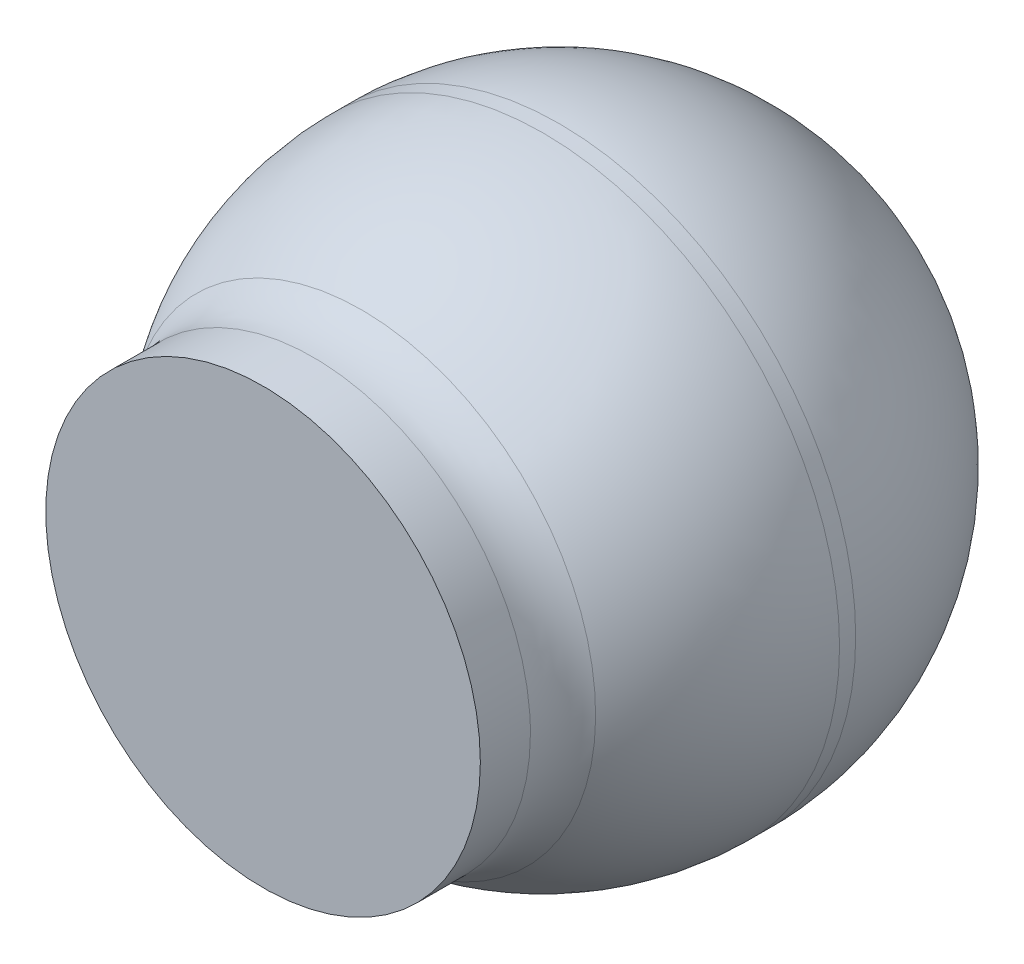
ISO-10303-21;
HEADER;
FILE_DESCRIPTION(('STEP AP214'),'2;1');
FILE_NAME('part.step','',(''),(''),'','','');
FILE_SCHEMA(('AUTOMOTIVE_DESIGN { 1 0 10303 214 1 1 1 1 }'));
ENDSEC;
DATA;
#1=APPLICATION_CONTEXT('core data for automotive mechanical design processes');
#2=APPLICATION_PROTOCOL_DEFINITION('international standard','automotive_design',2000,#1);
#3=PRODUCT_CONTEXT('',#1,'mechanical');
#4=PRODUCT('Part','Part','',(#3));
#5=PRODUCT_RELATED_PRODUCT_CATEGORY('part','',(#4));
#6=PRODUCT_DEFINITION_FORMATION('','',#4);
#7=PRODUCT_DEFINITION_CONTEXT('part definition',#1,'design');
#8=PRODUCT_DEFINITION('design','',#6,#7);
#9=PRODUCT_DEFINITION_SHAPE('','',#8);
#10=(LENGTH_UNIT() NAMED_UNIT(*) SI_UNIT(.MILLI.,.METRE.));
#11=(NAMED_UNIT(*) PLANE_ANGLE_UNIT() SI_UNIT($,.RADIAN.));
#12=(NAMED_UNIT(*) SI_UNIT($,.STERADIAN.) SOLID_ANGLE_UNIT());
#13=UNCERTAINTY_MEASURE_WITH_UNIT(LENGTH_MEASURE(1.E-05),#10,'distance_accuracy_value','');
#14=(GEOMETRIC_REPRESENTATION_CONTEXT(3) GLOBAL_UNCERTAINTY_ASSIGNED_CONTEXT((#13)) GLOBAL_UNIT_ASSIGNED_CONTEXT((#10,
#11,#12)) REPRESENTATION_CONTEXT('',''));
#15=CARTESIAN_POINT('',(0.,0.,0.));
#16=DIRECTION('',(0.,0.,1.));
#17=DIRECTION('',(1.,0.,0.));
#18=AXIS2_PLACEMENT_3D('',#15,#16,#17);
#19=CARTESIAN_POINT('',(-4.372919922269,-7.861349291452,10.006534503384));
#20=DIRECTION('',(0.,0.,-1.));
#21=DIRECTION('',(-1.,0.,0.));
#22=AXIS2_PLACEMENT_3D('',#19,#20,#21);
#23=PLANE('',#22);
#24=CARTESIAN_POINT('',(-4.372919922269,-7.861349291452,10.006534503384));
#25=DIRECTION('',(0.,0.,1.));
#26=DIRECTION('',(1.,0.,0.));
#27=AXIS2_PLACEMENT_3D('',#24,#25,#26);
#28=CIRCLE('',#27,0.275);
#29=CARTESIAN_POINT('',(-4.097919922269,-7.861349291452,10.006534503384));
#30=VERTEX_POINT('',#29);
#31=EDGE_CURVE('E20',#30,#30,#28,.F.);
#32=ORIENTED_EDGE('',*,*,#31,.F.);
#33=EDGE_LOOP('',(#32));
#34=FACE_BOUND('',#33,.T.);
#35=ADVANCED_FACE('F17',(#34),#23,.F.);
#36=CARTESIAN_POINT('',(-4.372919922269,-7.861349291452,9.906534503384));
#37=DIRECTION('',(0.,0.,1.));
#38=DIRECTION('',(1.,0.,0.));
#39=AXIS2_PLACEMENT_3D('',#36,#37,#38);
#40=CYLINDRICAL_SURFACE('',#39,0.275);
#41=CARTESIAN_POINT('',(-4.372919922269,-7.861349291452,9.943180457728));
#42=DIRECTION('',(0.,0.,-1.));
#43=DIRECTION('',(0.996700902337582,0.081162252799247,0.));
#44=AXIS2_PLACEMENT_3D('',#41,#42,#43);
#45=CIRCLE('',#44,0.275);
#46=CARTESIAN_POINT('',(-4.09882717412617,-7.83902967193221,9.943180457728));
#47=VERTEX_POINT('',#46);
#48=EDGE_CURVE('E65',#47,#47,#45,.F.);
#49=ORIENTED_EDGE('',*,*,#48,.T.);
#50=EDGE_LOOP('',(#49));
#51=FACE_BOUND('',#50,.T.);
#52=ORIENTED_EDGE('',*,*,#31,.T.);
#53=EDGE_LOOP('',(#52));
#54=FACE_BOUND('',#53,.T.);
#55=ADVANCED_FACE('F62',(#51,#54),#40,.T.);
#56=CARTESIAN_POINT('',(-4.372919922269,-7.861349291452,9.943180457728));
#57=DIRECTION('',(0.,0.,-1.));
#58=DIRECTION('',(0.996700902337583,0.0811622527992448,0.));
#59=AXIS2_PLACEMENT_3D('',#56,#57,#58);
#60=TOROIDAL_SURFACE('',#59,0.375,0.1);
#61=ORIENTED_EDGE('',*,*,#48,.F.);
#62=EDGE_LOOP('',(#61));
#63=FACE_BOUND('',#62,.T.);
#64=CARTESIAN_POINT('',(-4.372919922269,-7.861349291452,9.881744931236));
#65=DIRECTION('',(0.,0.,-1.));
#66=DIRECTION('',(-0.996700902337598,-0.0811622527990622,0.));
#67=AXIS2_PLACEMENT_3D('',#64,#65,#66);
#68=CIRCLE('',#67,0.296097046412665);
#69=CARTESIAN_POINT('',(-4.668040115608,-7.885381194786,9.881744931236));
#70=VERTEX_POINT('',#69);
#71=EDGE_CURVE('E39',#70,#70,#68,.T.);
#72=ORIENTED_EDGE('',*,*,#71,.F.);
#73=EDGE_LOOP('',(#72));
#74=FACE_BOUND('',#73,.T.);
#75=ADVANCED_FACE('F57',(#63,#74),#60,.F.);
#76=CARTESIAN_POINT('',(-4.746682760645,-7.891785136252,9.651976062157));
#77=CARTESIAN_POINT('',(-4.746682760645,-7.891785136252,9.701461392103));
#78=CARTESIAN_POINT('',(-4.738526217348,-7.891120941579,9.750947004335));
#79=CARTESIAN_POINT('',(-4.722207085349,-7.889792059952,9.798626332798));
#80=CARTESIAN_POINT('',(-4.698341390838,-7.887848654938,9.842699544317));
#81=CARTESIAN_POINT('',(-4.668040115608,-7.885381194786,9.881744931236));
#82=(BOUNDED_CURVE() B_SPLINE_CURVE(5,(#76,#77,#78,#79,#80,#81),.UNSPECIFIED.,.F.,
.F.) B_SPLINE_CURVE_WITH_KNOTS((6,6),(0.,0.661568582165),
.UNSPECIFIED.) CURVE() GEOMETRIC_REPRESENTATION_ITEM() RATIONAL_B_SPLINE_CURVE((1.,1.,1.,1.,1.,1.)) REPRESENTATION_ITEM(''));
#83=CARTESIAN_POINT('',(-4.372919922269,-7.861349291452,9.651976062157));
#84=DIRECTION('',(0.,0.,-1.));
#85=AXIS1_PLACEMENT('',#83,#84);
#86=SURFACE_OF_REVOLUTION('',#82,#85);
#87=CARTESIAN_POINT('',(-4.372919922269,-7.861349291452,9.651976062157));
#88=DIRECTION('',(0.,0.,1.));
#89=DIRECTION('',(1.,0.,0.));
#90=AXIS2_PLACEMENT_3D('',#87,#88,#89);
#91=CIRCLE('',#90,0.375);
#92=CARTESIAN_POINT('',(-3.997919922269,-7.861349291452,9.651976062157));
#93=VERTEX_POINT('',#92);
#94=EDGE_CURVE('E36',#93,#93,#91,.F.);
#95=ORIENTED_EDGE('',*,*,#94,.F.);
#96=EDGE_LOOP('',(#95));
#97=FACE_BOUND('',#96,.T.);
#98=ORIENTED_EDGE('',*,*,#71,.T.);
#99=EDGE_LOOP('',(#98));
#100=FACE_BOUND('',#99,.T.);
#101=ADVANCED_FACE('F53',(#97,#100),#86,.F.);
#102=CARTESIAN_POINT('',(-4.372919922269,-7.861349291452,9.256534503384));
#103=DIRECTION('',(0.,0.,1.));
#104=DIRECTION('',(1.,0.,0.));
#105=AXIS2_PLACEMENT_3D('',#102,#103,#104);
#106=CYLINDRICAL_SURFACE('',#105,0.375);
#107=CARTESIAN_POINT('',(-4.372919922269,-7.861349291452,9.631534503384));
#108=DIRECTION('',(0.,0.,-1.));
#109=DIRECTION('',(0.0811622527992357,-0.996700902337583,0.));
#110=AXIS2_PLACEMENT_3D('',#107,#108,#109);
#111=CIRCLE('',#110,0.375);
#112=CARTESIAN_POINT('',(-4.34248407746929,-8.23511212982859,9.631534503384));
#113=VERTEX_POINT('',#112);
#114=CARTESIAN_POINT('',(-4.40335576706871,-7.48758645307541,9.631534503384));
#115=VERTEX_POINT('',#114);
#116=EDGE_CURVE('E11',#113,#115,#111,.T.);
#117=ORIENTED_EDGE('',*,*,#116,.F.);
#118=CARTESIAN_POINT('',(-4.372919922269,-7.861349291452,9.631534503384));
#119=DIRECTION('',(0.,0.,1.));
#120=DIRECTION('',(0.0811622527992365,-0.996700902337583,0.));
#121=AXIS2_PLACEMENT_3D('',#118,#119,#120);
#122=CIRCLE('',#121,0.375);
#123=EDGE_CURVE('E25',#115,#113,#122,.F.);
#124=ORIENTED_EDGE('',*,*,#123,.F.);
#125=EDGE_LOOP('',(#117,#124));
#126=FACE_BOUND('',#125,.T.);
#127=ORIENTED_EDGE('',*,*,#94,.T.);
#128=EDGE_LOOP('',(#127));
#129=FACE_BOUND('',#128,.T.);
#130=ADVANCED_FACE('F34',(#126,#129),#106,.T.);
#131=CARTESIAN_POINT('',(-4.372919922269,-7.861349291452,9.631534503384));
#132=DIRECTION('',(0.0811622527992361,-0.996700902337583,0.));
#133=DIRECTION('',(-0.996700902337583,-0.0811622527992361,0.));
#134=AXIS2_PLACEMENT_3D('',#131,#132,#133);
#135=SPHERICAL_SURFACE('',#134,0.375);
#136=ORIENTED_EDGE('',*,*,#123,.T.);
#137=ORIENTED_EDGE('',*,*,#116,.T.);
#138=EDGE_LOOP('',(#136,#137));
#139=FACE_BOUND('',#138,.T.);
#140=ADVANCED_FACE('F32',(#139),#135,.T.);
#141=CLOSED_SHELL('',(#35,#55,#75,#101,#130,#140));
#142=MANIFOLD_SOLID_BREP('B1',#141);
#143=ADVANCED_BREP_SHAPE_REPRESENTATION('',(#18,#142),#14);
#144=SHAPE_DEFINITION_REPRESENTATION(#9,#143);
ENDSEC;
END-ISO-10303-21;
